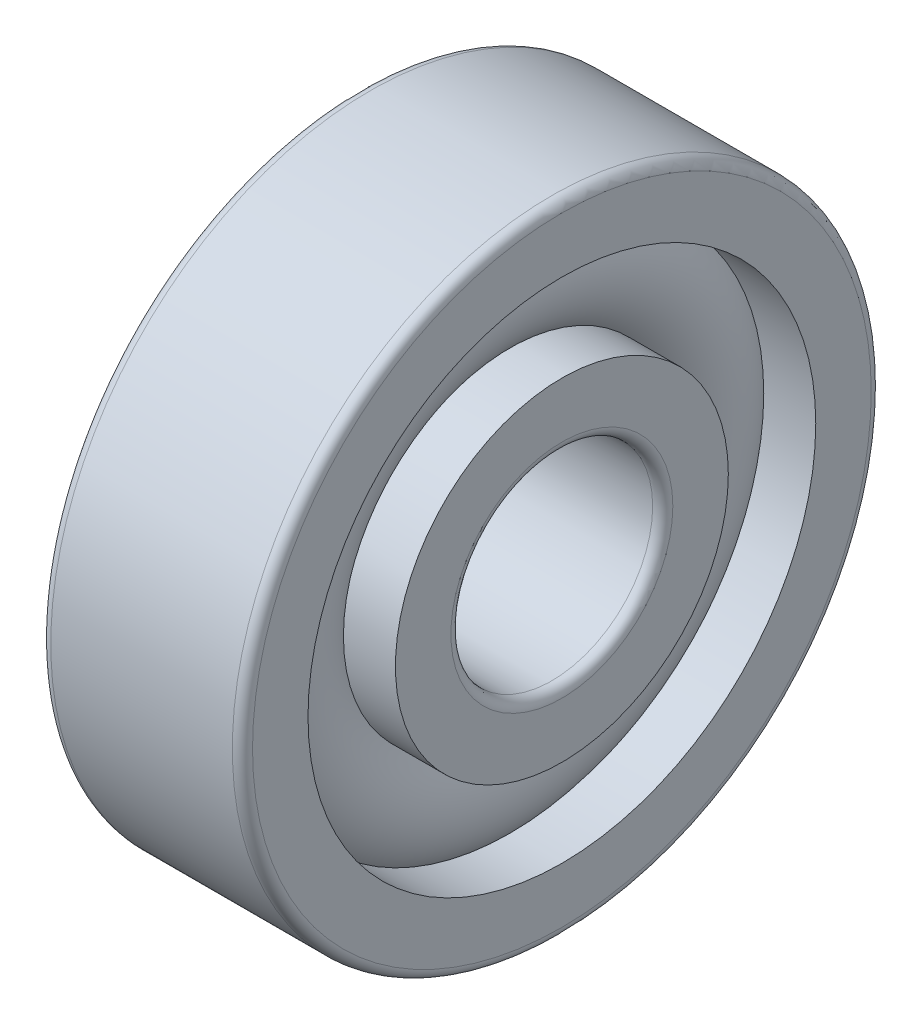
ISO-10303-21;
HEADER;
FILE_DESCRIPTION(('STEP AP214'),'2;1');
FILE_NAME('part.step','',(''),(''),'','','');
FILE_SCHEMA(('AUTOMOTIVE_DESIGN { 1 0 10303 214 1 1 1 1 }'));
ENDSEC;
DATA;
#1=APPLICATION_CONTEXT('core data for automotive mechanical design processes');
#2=APPLICATION_PROTOCOL_DEFINITION('international standard','automotive_design',2000,#1);
#3=PRODUCT_CONTEXT('',#1,'mechanical');
#4=PRODUCT('Part','Part','',(#3));
#5=PRODUCT_RELATED_PRODUCT_CATEGORY('part','',(#4));
#6=PRODUCT_DEFINITION_FORMATION('','',#4);
#7=PRODUCT_DEFINITION_CONTEXT('part definition',#1,'design');
#8=PRODUCT_DEFINITION('design','',#6,#7);
#9=PRODUCT_DEFINITION_SHAPE('','',#8);
#10=(LENGTH_UNIT() NAMED_UNIT(*) SI_UNIT(.MILLI.,.METRE.));
#11=(NAMED_UNIT(*) PLANE_ANGLE_UNIT() SI_UNIT($,.RADIAN.));
#12=(NAMED_UNIT(*) SI_UNIT($,.STERADIAN.) SOLID_ANGLE_UNIT());
#13=UNCERTAINTY_MEASURE_WITH_UNIT(LENGTH_MEASURE(1.E-05),#10,'distance_accuracy_value','');
#14=(GEOMETRIC_REPRESENTATION_CONTEXT(3) GLOBAL_UNCERTAINTY_ASSIGNED_CONTEXT((#13)) GLOBAL_UNIT_ASSIGNED_CONTEXT((#10,
#11,#12)) REPRESENTATION_CONTEXT('',''));
#15=CARTESIAN_POINT('',(0.,0.,0.));
#16=DIRECTION('',(0.,0.,1.));
#17=DIRECTION('',(1.,0.,0.));
#18=AXIS2_PLACEMENT_3D('',#15,#16,#17);
#19=CARTESIAN_POINT('',(0.,0.,0.));
#20=DIRECTION('',(-1.,0.,0.));
#21=DIRECTION('',(0.,0.,1.));
#22=AXIS2_PLACEMENT_3D('',#19,#20,#21);
#23=TOROIDAL_SURFACE('',#22,6.25,1.95);
#24=CARTESIAN_POINT('',(1.45344418537486,0.,0.));
#25=DIRECTION('',(-1.,0.,0.));
#26=DIRECTION('',(0.,0.,1.));
#27=AXIS2_PLACEMENT_3D('',#24,#25,#26);
#28=CIRCLE('',#27,7.55);
#29=CARTESIAN_POINT('',(1.45344418537486,0.,7.55));
#30=VERTEX_POINT('',#29);
#31=EDGE_CURVE('E35',#30,#30,#28,.F.);
#32=ORIENTED_EDGE('',*,*,#31,.T.);
#33=EDGE_LOOP('',(#32));
#34=FACE_BOUND('',#33,.T.);
#35=CARTESIAN_POINT('',(1.45344418537486,0.,0.));
#36=DIRECTION('',(-1.,0.,0.));
#37=DIRECTION('',(0.,0.,1.));
#38=AXIS2_PLACEMENT_3D('',#35,#36,#37);
#39=CIRCLE('',#38,4.95);
#40=CARTESIAN_POINT('',(1.45344418537486,0.,4.95));
#41=VERTEX_POINT('',#40);
#42=EDGE_CURVE('E10',#41,#41,#39,.T.);
#43=ORIENTED_EDGE('',*,*,#42,.T.);
#44=EDGE_LOOP('',(#43));
#45=FACE_BOUND('',#44,.T.);
#46=ADVANCED_FACE('F31',(#34,#45),#23,.T.);
#47=CARTESIAN_POINT('',(-20.6375,0.,0.));
#48=DIRECTION('',(1.,0.,0.));
#49=DIRECTION('',(0.,0.,-1.));
#50=AXIS2_PLACEMENT_3D('',#47,#48,#49);
#51=CYLINDRICAL_SURFACE('',#50,4.95);
#52=CARTESIAN_POINT('',(3.,0.,0.));
#53=DIRECTION('',(1.,0.,0.));
#54=DIRECTION('',(0.,0.,-1.));
#55=AXIS2_PLACEMENT_3D('',#52,#53,#54);
#56=CIRCLE('',#55,4.95);
#57=CARTESIAN_POINT('',(3.,0.,-4.95));
#58=VERTEX_POINT('',#57);
#59=EDGE_CURVE('E44',#58,#58,#56,.T.);
#60=ORIENTED_EDGE('',*,*,#59,.F.);
#61=EDGE_LOOP('',(#60));
#62=FACE_BOUND('',#61,.T.);
#63=ORIENTED_EDGE('',*,*,#42,.F.);
#64=EDGE_LOOP('',(#63));
#65=FACE_BOUND('',#64,.T.);
#66=ADVANCED_FACE('F83',(#62,#65),#51,.T.);
#67=CARTESIAN_POINT('',(-20.6375,0.,0.));
#68=DIRECTION('',(1.,0.,0.));
#69=DIRECTION('',(0.,0.,-1.));
#70=AXIS2_PLACEMENT_3D('',#67,#68,#69);
#71=CYLINDRICAL_SURFACE('',#70,4.95);
#72=CARTESIAN_POINT('',(-3.,0.,0.));
#73=DIRECTION('',(1.,0.,0.));
#74=DIRECTION('',(0.,0.,-1.));
#75=AXIS2_PLACEMENT_3D('',#72,#73,#74);
#76=CIRCLE('',#75,4.95);
#77=CARTESIAN_POINT('',(-3.,0.,-4.95));
#78=VERTEX_POINT('',#77);
#79=EDGE_CURVE('E53',#78,#78,#76,.T.);
#80=ORIENTED_EDGE('',*,*,#79,.T.);
#81=EDGE_LOOP('',(#80));
#82=FACE_BOUND('',#81,.T.);
#83=CARTESIAN_POINT('',(-1.45344418537486,0.,0.));
#84=DIRECTION('',(1.,0.,0.));
#85=DIRECTION('',(0.,0.,-1.));
#86=AXIS2_PLACEMENT_3D('',#83,#84,#85);
#87=CIRCLE('',#86,4.95);
#88=CARTESIAN_POINT('',(-1.45344418537486,0.,-4.95));
#89=VERTEX_POINT('',#88);
#90=EDGE_CURVE('E39',#89,#89,#87,.T.);
#91=ORIENTED_EDGE('',*,*,#90,.F.);
#92=EDGE_LOOP('',(#91));
#93=FACE_BOUND('',#92,.T.);
#94=ADVANCED_FACE('F86',(#82,#93),#71,.T.);
#95=CARTESIAN_POINT('',(3.,3.3,0.));
#96=DIRECTION('',(1.,0.,0.));
#97=DIRECTION('',(0.,0.,-1.));
#98=AXIS2_PLACEMENT_3D('',#95,#96,#97);
#99=PLANE('',#98);
#100=ORIENTED_EDGE('',*,*,#59,.T.);
#101=EDGE_LOOP('',(#100));
#102=FACE_BOUND('',#101,.T.);
#103=CARTESIAN_POINT('',(3.,0.,0.));
#104=DIRECTION('',(1.,0.,0.));
#105=DIRECTION('',(0.,0.,-1.));
#106=AXIS2_PLACEMENT_3D('',#103,#104,#105);
#107=CIRCLE('',#106,3.3);
#108=CARTESIAN_POINT('',(3.,0.,-3.3));
#109=VERTEX_POINT('',#108);
#110=EDGE_CURVE('E75',#109,#109,#107,.T.);
#111=ORIENTED_EDGE('',*,*,#110,.F.);
#112=EDGE_LOOP('',(#111));
#113=FACE_BOUND('',#112,.T.);
#114=ADVANCED_FACE('F80',(#102,#113),#99,.T.);
#115=CARTESIAN_POINT('',(2.7,0.,0.));
#116=DIRECTION('',(1.,0.,0.));
#117=DIRECTION('',(0.,0.,-1.));
#118=AXIS2_PLACEMENT_3D('',#115,#116,#117);
#119=TOROIDAL_SURFACE('',#118,3.3,0.3);
#120=ORIENTED_EDGE('',*,*,#110,.T.);
#121=EDGE_LOOP('',(#120));
#122=FACE_BOUND('',#121,.T.);
#123=CARTESIAN_POINT('',(2.7,0.,0.));
#124=DIRECTION('',(1.,0.,0.));
#125=DIRECTION('',(0.,0.,-1.));
#126=AXIS2_PLACEMENT_3D('',#123,#124,#125);
#127=CIRCLE('',#126,3.);
#128=CARTESIAN_POINT('',(2.7,0.,-3.));
#129=VERTEX_POINT('',#128);
#130=EDGE_CURVE('E72',#129,#129,#127,.T.);
#131=ORIENTED_EDGE('',*,*,#130,.F.);
#132=EDGE_LOOP('',(#131));
#133=FACE_BOUND('',#132,.T.);
#134=ADVANCED_FACE('F97',(#122,#133),#119,.T.);
#135=CARTESIAN_POINT('',(-20.6375,0.,0.));
#136=DIRECTION('',(1.,0.,0.));
#137=DIRECTION('',(0.,0.,-1.));
#138=AXIS2_PLACEMENT_3D('',#135,#136,#137);
#139=CYLINDRICAL_SURFACE('',#138,3.);
#140=ORIENTED_EDGE('',*,*,#130,.T.);
#141=EDGE_LOOP('',(#140));
#142=FACE_BOUND('',#141,.T.);
#143=CARTESIAN_POINT('',(-2.7,0.,0.));
#144=DIRECTION('',(1.,0.,0.));
#145=DIRECTION('',(0.,0.,-1.));
#146=AXIS2_PLACEMENT_3D('',#143,#144,#145);
#147=CIRCLE('',#146,3.);
#148=CARTESIAN_POINT('',(-2.7,0.,-3.));
#149=VERTEX_POINT('',#148);
#150=EDGE_CURVE('E69',#149,#149,#147,.T.);
#151=ORIENTED_EDGE('',*,*,#150,.F.);
#152=EDGE_LOOP('',(#151));
#153=FACE_BOUND('',#152,.T.);
#154=ADVANCED_FACE('F100',(#142,#153),#139,.F.);
#155=CARTESIAN_POINT('',(-2.7,0.,0.));
#156=DIRECTION('',(1.,0.,0.));
#157=DIRECTION('',(0.,0.,-1.));
#158=AXIS2_PLACEMENT_3D('',#155,#156,#157);
#159=TOROIDAL_SURFACE('',#158,3.3,0.3);
#160=ORIENTED_EDGE('',*,*,#150,.T.);
#161=EDGE_LOOP('',(#160));
#162=FACE_BOUND('',#161,.T.);
#163=CARTESIAN_POINT('',(-3.,0.,0.));
#164=DIRECTION('',(1.,0.,0.));
#165=DIRECTION('',(0.,0.,-1.));
#166=AXIS2_PLACEMENT_3D('',#163,#164,#165);
#167=CIRCLE('',#166,3.3);
#168=CARTESIAN_POINT('',(-3.,0.,-3.3));
#169=VERTEX_POINT('',#168);
#170=EDGE_CURVE('E66',#169,#169,#167,.T.);
#171=ORIENTED_EDGE('',*,*,#170,.F.);
#172=EDGE_LOOP('',(#171));
#173=FACE_BOUND('',#172,.T.);
#174=ADVANCED_FACE('F104',(#162,#173),#159,.T.);
#175=CARTESIAN_POINT('',(-3.,4.95,0.));
#176=DIRECTION('',(-1.,0.,0.));
#177=DIRECTION('',(0.,0.,1.));
#178=AXIS2_PLACEMENT_3D('',#175,#176,#177);
#179=PLANE('',#178);
#180=ORIENTED_EDGE('',*,*,#170,.T.);
#181=EDGE_LOOP('',(#180));
#182=FACE_BOUND('',#181,.T.);
#183=ORIENTED_EDGE('',*,*,#79,.F.);
#184=EDGE_LOOP('',(#183));
#185=FACE_BOUND('',#184,.T.);
#186=ADVANCED_FACE('F108',(#182,#185),#179,.T.);
#187=CARTESIAN_POINT('',(-1.45344418537486,0.,0.));
#188=DIRECTION('',(1.,0.,0.));
#189=DIRECTION('',(0.,0.,-1.));
#190=AXIS2_PLACEMENT_3D('',#187,#188,#189);
#191=CIRCLE('',#190,7.55);
#192=CARTESIAN_POINT('',(-1.45344418537486,0.,-7.55));
#193=VERTEX_POINT('',#192);
#194=EDGE_CURVE('E47',#193,#193,#191,.F.);
#195=ORIENTED_EDGE('',*,*,#194,.T.);
#196=EDGE_LOOP('',(#195));
#197=FACE_BOUND('',#196,.T.);
#198=ORIENTED_EDGE('',*,*,#90,.T.);
#199=EDGE_LOOP('',(#198));
#200=FACE_BOUND('',#199,.T.);
#201=ADVANCED_FACE('F33',(#197,#200),#23,.T.);
#202=CARTESIAN_POINT('',(-20.6375,0.,0.));
#203=DIRECTION('',(1.,0.,0.));
#204=DIRECTION('',(0.,0.,-1.));
#205=AXIS2_PLACEMENT_3D('',#202,#203,#204);
#206=CYLINDRICAL_SURFACE('',#205,7.55);
#207=CARTESIAN_POINT('',(3.,0.,0.));
#208=DIRECTION('',(1.,0.,0.));
#209=DIRECTION('',(0.,0.,-1.));
#210=AXIS2_PLACEMENT_3D('',#207,#208,#209);
#211=CIRCLE('',#210,7.55);
#212=CARTESIAN_POINT('',(3.,0.,-7.55));
#213=VERTEX_POINT('',#212);
#214=EDGE_CURVE('E49',#213,#213,#211,.T.);
#215=ORIENTED_EDGE('',*,*,#214,.T.);
#216=EDGE_LOOP('',(#215));
#217=FACE_BOUND('',#216,.T.);
#218=ORIENTED_EDGE('',*,*,#31,.F.);
#219=EDGE_LOOP('',(#218));
#220=FACE_BOUND('',#219,.T.);
#221=ADVANCED_FACE('F113',(#217,#220),#206,.F.);
#222=CARTESIAN_POINT('',(-20.6375,0.,0.));
#223=DIRECTION('',(1.,0.,0.));
#224=DIRECTION('',(0.,0.,-1.));
#225=AXIS2_PLACEMENT_3D('',#222,#223,#224);
#226=CYLINDRICAL_SURFACE('',#225,7.55);
#227=CARTESIAN_POINT('',(-3.,0.,0.));
#228=DIRECTION('',(1.,0.,0.));
#229=DIRECTION('',(0.,0.,-1.));
#230=AXIS2_PLACEMENT_3D('',#227,#228,#229);
#231=CIRCLE('',#230,7.55);
#232=CARTESIAN_POINT('',(-3.,0.,-7.55));
#233=VERTEX_POINT('',#232);
#234=EDGE_CURVE('E144',#233,#233,#231,.T.);
#235=ORIENTED_EDGE('',*,*,#234,.F.);
#236=EDGE_LOOP('',(#235));
#237=FACE_BOUND('',#236,.T.);
#238=ORIENTED_EDGE('',*,*,#194,.F.);
#239=EDGE_LOOP('',(#238));
#240=FACE_BOUND('',#239,.T.);
#241=ADVANCED_FACE('F116',(#237,#240),#226,.F.);
#242=CARTESIAN_POINT('',(3.,9.2,0.));
#243=DIRECTION('',(1.,0.,0.));
#244=DIRECTION('',(0.,0.,-1.));
#245=AXIS2_PLACEMENT_3D('',#242,#243,#244);
#246=PLANE('',#245);
#247=CARTESIAN_POINT('',(3.,0.,0.));
#248=DIRECTION('',(1.,0.,0.));
#249=DIRECTION('',(0.,0.,-1.));
#250=AXIS2_PLACEMENT_3D('',#247,#248,#249);
#251=CIRCLE('',#250,9.2);
#252=CARTESIAN_POINT('',(3.,0.,-9.2));
#253=VERTEX_POINT('',#252);
#254=EDGE_CURVE('E55',#253,#253,#251,.T.);
#255=ORIENTED_EDGE('',*,*,#254,.T.);
#256=EDGE_LOOP('',(#255));
#257=FACE_BOUND('',#256,.T.);
#258=ORIENTED_EDGE('',*,*,#214,.F.);
#259=EDGE_LOOP('',(#258));
#260=FACE_BOUND('',#259,.T.);
#261=ADVANCED_FACE('F117',(#257,#260),#246,.T.);
#262=CARTESIAN_POINT('',(2.7,0.,0.));
#263=DIRECTION('',(1.,0.,0.));
#264=DIRECTION('',(0.,0.,-1.));
#265=AXIS2_PLACEMENT_3D('',#262,#263,#264);
#266=TOROIDAL_SURFACE('',#265,9.2,0.3);
#267=CARTESIAN_POINT('',(2.7,0.,0.));
#268=DIRECTION('',(1.,0.,0.));
#269=DIRECTION('',(0.,0.,-1.));
#270=AXIS2_PLACEMENT_3D('',#267,#268,#269);
#271=CIRCLE('',#270,9.5);
#272=CARTESIAN_POINT('',(2.7,0.,-9.5));
#273=VERTEX_POINT('',#272);
#274=EDGE_CURVE('E60',#273,#273,#271,.T.);
#275=ORIENTED_EDGE('',*,*,#274,.T.);
#276=EDGE_LOOP('',(#275));
#277=FACE_BOUND('',#276,.T.);
#278=ORIENTED_EDGE('',*,*,#254,.F.);
#279=EDGE_LOOP('',(#278));
#280=FACE_BOUND('',#279,.T.);
#281=ADVANCED_FACE('F120',(#277,#280),#266,.T.);
#282=CARTESIAN_POINT('',(-20.6375,0.,0.));
#283=DIRECTION('',(1.,0.,0.));
#284=DIRECTION('',(0.,0.,-1.));
#285=AXIS2_PLACEMENT_3D('',#282,#283,#284);
#286=CYLINDRICAL_SURFACE('',#285,9.5);
#287=CARTESIAN_POINT('',(-2.7,0.,0.));
#288=DIRECTION('',(1.,0.,0.));
#289=DIRECTION('',(0.,0.,-1.));
#290=AXIS2_PLACEMENT_3D('',#287,#288,#289);
#291=CIRCLE('',#290,9.5);
#292=CARTESIAN_POINT('',(-2.7,0.,-9.5));
#293=VERTEX_POINT('',#292);
#294=EDGE_CURVE('E148',#293,#293,#291,.T.);
#295=ORIENTED_EDGE('',*,*,#294,.T.);
#296=EDGE_LOOP('',(#295));
#297=FACE_BOUND('',#296,.T.);
#298=ORIENTED_EDGE('',*,*,#274,.F.);
#299=EDGE_LOOP('',(#298));
#300=FACE_BOUND('',#299,.T.);
#301=ADVANCED_FACE('F124',(#297,#300),#286,.T.);
#302=CARTESIAN_POINT('',(-2.7,0.,0.));
#303=DIRECTION('',(1.,0.,0.));
#304=DIRECTION('',(0.,0.,-1.));
#305=AXIS2_PLACEMENT_3D('',#302,#303,#304);
#306=TOROIDAL_SURFACE('',#305,9.2,0.3);
#307=CARTESIAN_POINT('',(-3.,0.,0.));
#308=DIRECTION('',(1.,0.,0.));
#309=DIRECTION('',(0.,0.,-1.));
#310=AXIS2_PLACEMENT_3D('',#307,#308,#309);
#311=CIRCLE('',#310,9.2);
#312=CARTESIAN_POINT('',(-3.,0.,-9.2));
#313=VERTEX_POINT('',#312);
#314=EDGE_CURVE('E145',#313,#313,#311,.T.);
#315=ORIENTED_EDGE('',*,*,#314,.T.);
#316=EDGE_LOOP('',(#315));
#317=FACE_BOUND('',#316,.T.);
#318=ORIENTED_EDGE('',*,*,#294,.F.);
#319=EDGE_LOOP('',(#318));
#320=FACE_BOUND('',#319,.T.);
#321=ADVANCED_FACE('F128',(#317,#320),#306,.T.);
#322=CARTESIAN_POINT('',(-3.,7.55,0.));
#323=DIRECTION('',(-1.,0.,0.));
#324=DIRECTION('',(0.,0.,1.));
#325=AXIS2_PLACEMENT_3D('',#322,#323,#324);
#326=PLANE('',#325);
#327=ORIENTED_EDGE('',*,*,#234,.T.);
#328=EDGE_LOOP('',(#327));
#329=FACE_BOUND('',#328,.T.);
#330=ORIENTED_EDGE('',*,*,#314,.F.);
#331=EDGE_LOOP('',(#330));
#332=FACE_BOUND('',#331,.T.);
#333=ADVANCED_FACE('F132',(#329,#332),#326,.T.);
#334=CLOSED_SHELL('',(#46,#66,#94,#114,#134,#154,#174,#186,#201,#221,#241,#261,#281,#301,#321,#333));
#335=MANIFOLD_SOLID_BREP('B2',#334);
#336=ADVANCED_BREP_SHAPE_REPRESENTATION('',(#18,#335),#14);
#337=SHAPE_DEFINITION_REPRESENTATION(#9,#336);
ENDSEC;
END-ISO-10303-21;
